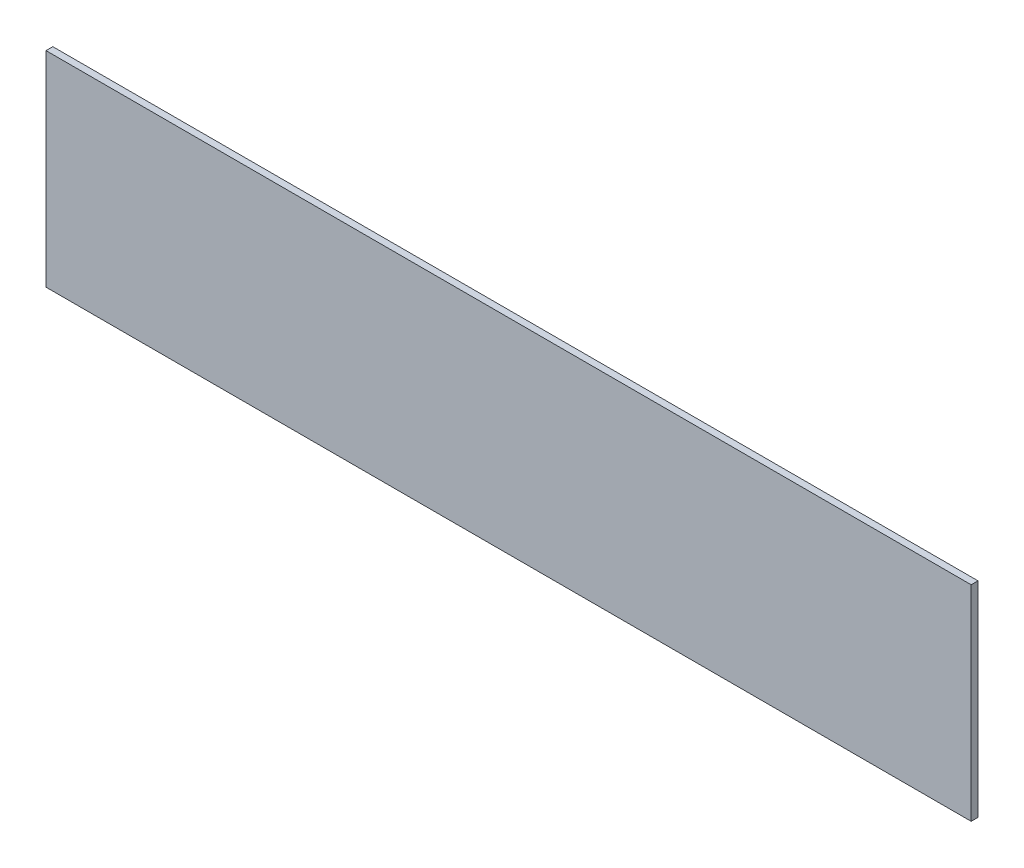
ISO-10303-21;
HEADER;
FILE_DESCRIPTION(('STEP AP214'),'2;1');
FILE_NAME('part.step','',(''),(''),'','','');
FILE_SCHEMA(('AUTOMOTIVE_DESIGN { 1 0 10303 214 1 1 1 1 }'));
ENDSEC;
DATA;
#1=APPLICATION_CONTEXT('core data for automotive mechanical design processes');
#2=APPLICATION_PROTOCOL_DEFINITION('international standard','automotive_design',2000,#1);
#3=PRODUCT_CONTEXT('',#1,'mechanical');
#4=PRODUCT('Part','Part','',(#3));
#5=PRODUCT_RELATED_PRODUCT_CATEGORY('part','',(#4));
#6=PRODUCT_DEFINITION_FORMATION('','',#4);
#7=PRODUCT_DEFINITION_CONTEXT('part definition',#1,'design');
#8=PRODUCT_DEFINITION('design','',#6,#7);
#9=PRODUCT_DEFINITION_SHAPE('','',#8);
#10=(LENGTH_UNIT() NAMED_UNIT(*) SI_UNIT(.MILLI.,.METRE.));
#11=(NAMED_UNIT(*) PLANE_ANGLE_UNIT() SI_UNIT($,.RADIAN.));
#12=(NAMED_UNIT(*) SI_UNIT($,.STERADIAN.) SOLID_ANGLE_UNIT());
#13=UNCERTAINTY_MEASURE_WITH_UNIT(LENGTH_MEASURE(1.E-05),#10,'distance_accuracy_value','');
#14=(GEOMETRIC_REPRESENTATION_CONTEXT(3) GLOBAL_UNCERTAINTY_ASSIGNED_CONTEXT((#13)) GLOBAL_UNIT_ASSIGNED_CONTEXT((#10,
#11,#12)) REPRESENTATION_CONTEXT('',''));
#15=CARTESIAN_POINT('',(0.,0.,0.));
#16=DIRECTION('',(0.,0.,1.));
#17=DIRECTION('',(1.,0.,0.));
#18=AXIS2_PLACEMENT_3D('',#15,#16,#17);
#19=CARTESIAN_POINT('',(-101.6,-22.5,1.5));
#20=DIRECTION('',(1.,0.,0.));
#21=DIRECTION('',(0.,0.,-1.));
#22=AXIS2_PLACEMENT_3D('',#19,#20,#21);
#23=PLANE('',#22);
#24=DIRECTION('',(0.,-1.,0.));
#25=VECTOR('',#24,1.);
#26=CARTESIAN_POINT('',(-101.6,-22.5,0.));
#27=LINE('',#26,#25);
#28=CARTESIAN_POINT('',(-101.6,22.5,0.));
#29=VERTEX_POINT('',#28);
#30=CARTESIAN_POINT('',(-101.6,-22.5,0.));
#31=VERTEX_POINT('',#30);
#32=EDGE_CURVE('E96',#29,#31,#27,.T.);
#33=ORIENTED_EDGE('',*,*,#32,.T.);
#34=DIRECTION('',(0.,0.,-1.));
#35=VECTOR('',#34,1.);
#36=CARTESIAN_POINT('',(-101.6,-22.5,1.5));
#37=LINE('',#36,#35);
#38=CARTESIAN_POINT('',(-101.6,-22.5,1.5));
#39=VERTEX_POINT('',#38);
#40=EDGE_CURVE('E11',#39,#31,#37,.T.);
#41=ORIENTED_EDGE('',*,*,#40,.F.);
#42=DIRECTION('',(0.,-1.,0.));
#43=VECTOR('',#42,1.);
#44=CARTESIAN_POINT('',(-101.6,-22.5,1.5));
#45=LINE('',#44,#43);
#46=CARTESIAN_POINT('',(-101.6,22.5,1.5));
#47=VERTEX_POINT('',#46);
#48=EDGE_CURVE('E84',#47,#39,#45,.T.);
#49=ORIENTED_EDGE('',*,*,#48,.F.);
#50=DIRECTION('',(0.,0.,-1.));
#51=VECTOR('',#50,1.);
#52=CARTESIAN_POINT('',(-101.6,22.5,1.5));
#53=LINE('',#52,#51);
#54=EDGE_CURVE('E92',#47,#29,#53,.T.);
#55=ORIENTED_EDGE('',*,*,#54,.T.);
#56=EDGE_LOOP('',(#33,#41,#49,#55));
#57=FACE_BOUND('',#56,.T.);
#58=ADVANCED_FACE('F33',(#57),#23,.F.);
#59=CARTESIAN_POINT('',(101.6,-22.5,1.5));
#60=DIRECTION('',(0.,1.,0.));
#61=DIRECTION('',(-1.,0.,0.));
#62=AXIS2_PLACEMENT_3D('',#59,#60,#61);
#63=PLANE('',#62);
#64=DIRECTION('',(1.,0.,0.));
#65=VECTOR('',#64,1.);
#66=CARTESIAN_POINT('',(101.6,-22.5,0.));
#67=LINE('',#66,#65);
#68=CARTESIAN_POINT('',(101.6,-22.5,0.));
#69=VERTEX_POINT('',#68);
#70=EDGE_CURVE('E88',#31,#69,#67,.T.);
#71=ORIENTED_EDGE('',*,*,#70,.T.);
#72=DIRECTION('',(0.,0.,-1.));
#73=VECTOR('',#72,1.);
#74=CARTESIAN_POINT('',(101.6,-22.5,1.5));
#75=LINE('',#74,#73);
#76=CARTESIAN_POINT('',(101.6,-22.5,1.5));
#77=VERTEX_POINT('',#76);
#78=EDGE_CURVE('E41',#77,#69,#75,.T.);
#79=ORIENTED_EDGE('',*,*,#78,.F.);
#80=DIRECTION('',(1.,0.,0.));
#81=VECTOR('',#80,1.);
#82=CARTESIAN_POINT('',(101.6,-22.5,1.5));
#83=LINE('',#82,#81);
#84=EDGE_CURVE('E79',#39,#77,#83,.T.);
#85=ORIENTED_EDGE('',*,*,#84,.F.);
#86=ORIENTED_EDGE('',*,*,#40,.T.);
#87=EDGE_LOOP('',(#71,#79,#85,#86));
#88=FACE_BOUND('',#87,.T.);
#89=ADVANCED_FACE('F87',(#88),#63,.F.);
#90=CARTESIAN_POINT('',(101.6,-22.5,1.5));
#91=DIRECTION('',(-1.,0.,0.));
#92=DIRECTION('',(0.,0.,1.));
#93=AXIS2_PLACEMENT_3D('',#90,#91,#92);
#94=PLANE('',#93);
#95=DIRECTION('',(0.,1.,0.));
#96=VECTOR('',#95,1.);
#97=CARTESIAN_POINT('',(101.6,-22.5,0.));
#98=LINE('',#97,#96);
#99=CARTESIAN_POINT('',(101.6,22.5,0.));
#100=VERTEX_POINT('',#99);
#101=EDGE_CURVE('E66',#69,#100,#98,.T.);
#102=ORIENTED_EDGE('',*,*,#101,.T.);
#103=DIRECTION('',(0.,0.,-1.));
#104=VECTOR('',#103,1.);
#105=CARTESIAN_POINT('',(101.6,22.5,1.5));
#106=LINE('',#105,#104);
#107=CARTESIAN_POINT('',(101.6,22.5,1.5));
#108=VERTEX_POINT('',#107);
#109=EDGE_CURVE('E89',#108,#100,#106,.T.);
#110=ORIENTED_EDGE('',*,*,#109,.F.);
#111=DIRECTION('',(0.,1.,0.));
#112=VECTOR('',#111,1.);
#113=CARTESIAN_POINT('',(101.6,-22.5,1.5));
#114=LINE('',#113,#112);
#115=EDGE_CURVE('E82',#77,#108,#114,.T.);
#116=ORIENTED_EDGE('',*,*,#115,.F.);
#117=ORIENTED_EDGE('',*,*,#78,.T.);
#118=EDGE_LOOP('',(#102,#110,#116,#117));
#119=FACE_BOUND('',#118,.T.);
#120=ADVANCED_FACE('F90',(#119),#94,.F.);
#121=CARTESIAN_POINT('',(101.6,22.5,1.5));
#122=DIRECTION('',(0.,-1.,0.));
#123=DIRECTION('',(1.,0.,0.));
#124=AXIS2_PLACEMENT_3D('',#121,#122,#123);
#125=PLANE('',#124);
#126=DIRECTION('',(-1.,0.,0.));
#127=VECTOR('',#126,1.);
#128=CARTESIAN_POINT('',(101.6,22.5,0.));
#129=LINE('',#128,#127);
#130=EDGE_CURVE('E72',#100,#29,#129,.T.);
#131=ORIENTED_EDGE('',*,*,#130,.T.);
#132=ORIENTED_EDGE('',*,*,#54,.F.);
#133=DIRECTION('',(-1.,0.,0.));
#134=VECTOR('',#133,1.);
#135=CARTESIAN_POINT('',(101.6,22.5,1.5));
#136=LINE('',#135,#134);
#137=EDGE_CURVE('E49',#108,#47,#136,.T.);
#138=ORIENTED_EDGE('',*,*,#137,.F.);
#139=ORIENTED_EDGE('',*,*,#109,.T.);
#140=EDGE_LOOP('',(#131,#132,#138,#139));
#141=FACE_BOUND('',#140,.T.);
#142=ADVANCED_FACE('F103',(#141),#125,.F.);
#143=CARTESIAN_POINT('',(0.,0.,1.5));
#144=DIRECTION('',(0.,0.,1.));
#145=DIRECTION('',(1.,0.,0.));
#146=AXIS2_PLACEMENT_3D('',#143,#144,#145);
#147=PLANE('',#146);
#148=ORIENTED_EDGE('',*,*,#48,.T.);
#149=ORIENTED_EDGE('',*,*,#84,.T.);
#150=ORIENTED_EDGE('',*,*,#115,.T.);
#151=ORIENTED_EDGE('',*,*,#137,.T.);
#152=EDGE_LOOP('',(#148,#149,#150,#151));
#153=FACE_BOUND('',#152,.T.);
#154=ADVANCED_FACE('F80',(#153),#147,.T.);
#155=CARTESIAN_POINT('',(0.,0.,0.));
#156=DIRECTION('',(0.,0.,1.));
#157=DIRECTION('',(1.,0.,0.));
#158=AXIS2_PLACEMENT_3D('',#155,#156,#157);
#159=PLANE('',#158);
#160=ORIENTED_EDGE('',*,*,#32,.F.);
#161=ORIENTED_EDGE('',*,*,#130,.F.);
#162=ORIENTED_EDGE('',*,*,#101,.F.);
#163=ORIENTED_EDGE('',*,*,#70,.F.);
#164=EDGE_LOOP('',(#160,#161,#162,#163));
#165=FACE_BOUND('',#164,.T.);
#166=ADVANCED_FACE('F106',(#165),#159,.F.);
#167=CLOSED_SHELL('',(#58,#89,#120,#142,#154,#166));
#168=MANIFOLD_SOLID_BREP('B2',#167);
#169=ADVANCED_BREP_SHAPE_REPRESENTATION('',(#18,#168),#14);
#170=SHAPE_DEFINITION_REPRESENTATION(#9,#169);
ENDSEC;
END-ISO-10303-21;
